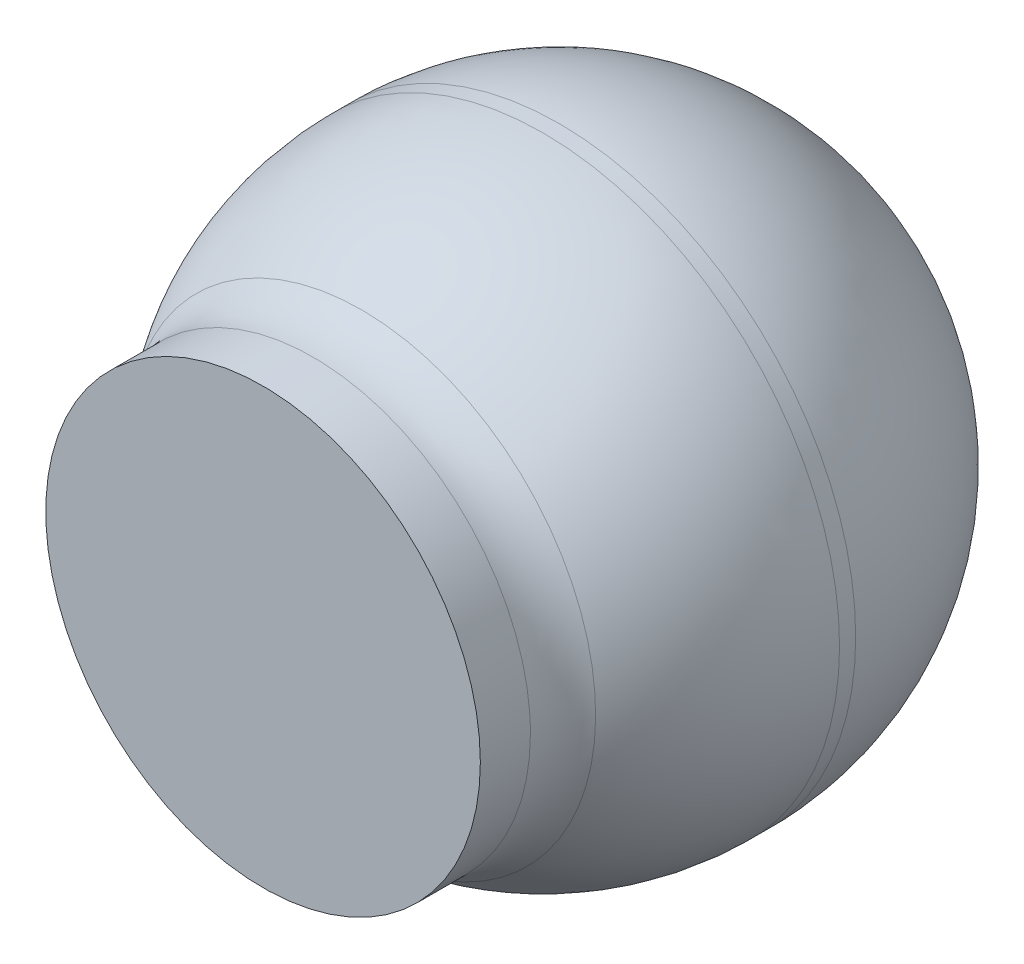
ISO-10303-21;
HEADER;
FILE_DESCRIPTION(('STEP AP214'),'2;1');
FILE_NAME('part.step','',(''),(''),'','','');
FILE_SCHEMA(('AUTOMOTIVE_DESIGN { 1 0 10303 214 1 1 1 1 }'));
ENDSEC;
DATA;
#1=APPLICATION_CONTEXT('core data for automotive mechanical design processes');
#2=APPLICATION_PROTOCOL_DEFINITION('international standard','automotive_design',2000,#1);
#3=PRODUCT_CONTEXT('',#1,'mechanical');
#4=PRODUCT('Part','Part','',(#3));
#5=PRODUCT_RELATED_PRODUCT_CATEGORY('part','',(#4));
#6=PRODUCT_DEFINITION_FORMATION('','',#4);
#7=PRODUCT_DEFINITION_CONTEXT('part definition',#1,'design');
#8=PRODUCT_DEFINITION('design','',#6,#7);
#9=PRODUCT_DEFINITION_SHAPE('','',#8);
#10=(LENGTH_UNIT() NAMED_UNIT(*) SI_UNIT(.MILLI.,.METRE.));
#11=(NAMED_UNIT(*) PLANE_ANGLE_UNIT() SI_UNIT($,.RADIAN.));
#12=(NAMED_UNIT(*) SI_UNIT($,.STERADIAN.) SOLID_ANGLE_UNIT());
#13=UNCERTAINTY_MEASURE_WITH_UNIT(LENGTH_MEASURE(1.E-05),#10,'distance_accuracy_value','');
#14=(GEOMETRIC_REPRESENTATION_CONTEXT(3) GLOBAL_UNCERTAINTY_ASSIGNED_CONTEXT((#13)) GLOBAL_UNIT_ASSIGNED_CONTEXT((#10,
#11,#12)) REPRESENTATION_CONTEXT('',''));
#15=CARTESIAN_POINT('',(0.,0.,0.));
#16=DIRECTION('',(0.,0.,1.));
#17=DIRECTION('',(1.,0.,0.));
#18=AXIS2_PLACEMENT_3D('',#15,#16,#17);
#19=CARTESIAN_POINT('',(0.707080077731,-0.241349291452,10.006534503384));
#20=DIRECTION('',(0.,0.,-1.));
#21=DIRECTION('',(-1.,0.,0.));
#22=AXIS2_PLACEMENT_3D('',#19,#20,#21);
#23=PLANE('',#22);
#24=CARTESIAN_POINT('',(0.707080077731,-0.241349291452,10.006534503384));
#25=DIRECTION('',(0.,0.,1.));
#26=DIRECTION('',(1.,0.,0.));
#27=AXIS2_PLACEMENT_3D('',#24,#25,#26);
#28=CIRCLE('',#27,0.275);
#29=CARTESIAN_POINT('',(0.982080077731,-0.241349291452,10.006534503384));
#30=VERTEX_POINT('',#29);
#31=EDGE_CURVE('E20',#30,#30,#28,.F.);
#32=ORIENTED_EDGE('',*,*,#31,.F.);
#33=EDGE_LOOP('',(#32));
#34=FACE_BOUND('',#33,.T.);
#35=ADVANCED_FACE('F17',(#34),#23,.F.);
#36=CARTESIAN_POINT('',(0.707080077731,-0.241349291452,9.906534503384));
#37=DIRECTION('',(0.,0.,1.));
#38=DIRECTION('',(1.,0.,0.));
#39=AXIS2_PLACEMENT_3D('',#36,#37,#38);
#40=CYLINDRICAL_SURFACE('',#39,0.275);
#41=CARTESIAN_POINT('',(0.707080077731,-0.241349291452,9.943180457728));
#42=DIRECTION('',(0.,0.,-1.));
#43=DIRECTION('',(0.996700902337583,0.081162252799246,0.));
#44=AXIS2_PLACEMENT_3D('',#41,#42,#43);
#45=CIRCLE('',#44,0.275);
#46=CARTESIAN_POINT('',(0.981172825873835,-0.219029671932207,9.943180457728));
#47=VERTEX_POINT('',#46);
#48=EDGE_CURVE('E65',#47,#47,#45,.F.);
#49=ORIENTED_EDGE('',*,*,#48,.T.);
#50=EDGE_LOOP('',(#49));
#51=FACE_BOUND('',#50,.T.);
#52=ORIENTED_EDGE('',*,*,#31,.T.);
#53=EDGE_LOOP('',(#52));
#54=FACE_BOUND('',#53,.T.);
#55=ADVANCED_FACE('F62',(#51,#54),#40,.T.);
#56=CARTESIAN_POINT('',(0.707080077731,-0.241349291452,9.943180457728));
#57=DIRECTION('',(0.,0.,-1.));
#58=DIRECTION('',(0.996700902337583,0.081162252799246,0.));
#59=AXIS2_PLACEMENT_3D('',#56,#57,#58);
#60=TOROIDAL_SURFACE('',#59,0.375,0.1);
#61=ORIENTED_EDGE('',*,*,#48,.F.);
#62=EDGE_LOOP('',(#61));
#63=FACE_BOUND('',#62,.T.);
#64=CARTESIAN_POINT('',(0.707080077731001,-0.241349291452,9.881744931236));
#65=DIRECTION('',(0.,0.,-1.));
#66=DIRECTION('',(-0.996700902337598,-0.0811622527990606,0.));
#67=AXIS2_PLACEMENT_3D('',#64,#65,#66);
#68=CIRCLE('',#67,0.296097046412665);
#69=CARTESIAN_POINT('',(0.411959884392,-0.265381194786,9.881744931236));
#70=VERTEX_POINT('',#69);
#71=EDGE_CURVE('E39',#70,#70,#68,.T.);
#72=ORIENTED_EDGE('',*,*,#71,.F.);
#73=EDGE_LOOP('',(#72));
#74=FACE_BOUND('',#73,.T.);
#75=ADVANCED_FACE('F57',(#63,#74),#60,.F.);
#76=CARTESIAN_POINT('',(0.333317239355,-0.271785136252,9.651976062157));
#77=CARTESIAN_POINT('',(0.333317239355,-0.271785136252,9.701461392103));
#78=CARTESIAN_POINT('',(0.341473782652,-0.271120941579,9.750947004335));
#79=CARTESIAN_POINT('',(0.357792914651,-0.269792059952,9.798626332798));
#80=CARTESIAN_POINT('',(0.381658609162,-0.267848654938,9.842699544317));
#81=CARTESIAN_POINT('',(0.411959884392,-0.265381194786,9.881744931236));
#82=(BOUNDED_CURVE() B_SPLINE_CURVE(5,(#76,#77,#78,#79,#80,#81),.UNSPECIFIED.,.F.,
.F.) B_SPLINE_CURVE_WITH_KNOTS((6,6),(0.,0.661568582165),
.UNSPECIFIED.) CURVE() GEOMETRIC_REPRESENTATION_ITEM() RATIONAL_B_SPLINE_CURVE((1.,1.,1.,1.,1.,1.)) REPRESENTATION_ITEM(''));
#83=CARTESIAN_POINT('',(0.707080077731,-0.241349291452,9.651976062157));
#84=DIRECTION('',(0.,0.,-1.));
#85=AXIS1_PLACEMENT('',#83,#84);
#86=SURFACE_OF_REVOLUTION('',#82,#85);
#87=CARTESIAN_POINT('',(0.707080077731001,-0.241349291452,9.651976062157));
#88=DIRECTION('',(0.,0.,1.));
#89=DIRECTION('',(1.,0.,0.));
#90=AXIS2_PLACEMENT_3D('',#87,#88,#89);
#91=CIRCLE('',#90,0.375);
#92=CARTESIAN_POINT('',(1.082080077731,-0.241349291452,9.651976062157));
#93=VERTEX_POINT('',#92);
#94=EDGE_CURVE('E36',#93,#93,#91,.F.);
#95=ORIENTED_EDGE('',*,*,#94,.F.);
#96=EDGE_LOOP('',(#95));
#97=FACE_BOUND('',#96,.T.);
#98=ORIENTED_EDGE('',*,*,#71,.T.);
#99=EDGE_LOOP('',(#98));
#100=FACE_BOUND('',#99,.T.);
#101=ADVANCED_FACE('F53',(#97,#100),#86,.F.);
#102=CARTESIAN_POINT('',(0.707080077731,-0.241349291452,9.256534503384));
#103=DIRECTION('',(0.,0.,1.));
#104=DIRECTION('',(1.,0.,0.));
#105=AXIS2_PLACEMENT_3D('',#102,#103,#104);
#106=CYLINDRICAL_SURFACE('',#105,0.375);
#107=CARTESIAN_POINT('',(0.707080077731,-0.241349291452,9.631534503384));
#108=DIRECTION('',(0.,0.,-1.));
#109=DIRECTION('',(0.0811622527992362,-0.996700902337583,0.));
#110=AXIS2_PLACEMENT_3D('',#107,#108,#109);
#111=CIRCLE('',#110,0.375);
#112=CARTESIAN_POINT('',(0.737515922530713,-0.615112129828594,9.631534503384));
#113=VERTEX_POINT('',#112);
#114=CARTESIAN_POINT('',(0.676644232931287,0.132413546924594,9.631534503384));
#115=VERTEX_POINT('',#114);
#116=EDGE_CURVE('E11',#113,#115,#111,.T.);
#117=ORIENTED_EDGE('',*,*,#116,.F.);
#118=CARTESIAN_POINT('',(0.707080077731,-0.241349291452,9.631534503384));
#119=DIRECTION('',(0.,0.,1.));
#120=DIRECTION('',(0.081162252799236,-0.996700902337583,0.));
#121=AXIS2_PLACEMENT_3D('',#118,#119,#120);
#122=CIRCLE('',#121,0.375);
#123=EDGE_CURVE('E25',#115,#113,#122,.F.);
#124=ORIENTED_EDGE('',*,*,#123,.F.);
#125=EDGE_LOOP('',(#117,#124));
#126=FACE_BOUND('',#125,.T.);
#127=ORIENTED_EDGE('',*,*,#94,.T.);
#128=EDGE_LOOP('',(#127));
#129=FACE_BOUND('',#128,.T.);
#130=ADVANCED_FACE('F34',(#126,#129),#106,.T.);
#131=CARTESIAN_POINT('',(0.707080077731,-0.241349291452,9.631534503384));
#132=DIRECTION('',(0.0811622527992361,-0.996700902337583,0.));
#133=DIRECTION('',(-0.996700902337583,-0.0811622527992361,0.));
#134=AXIS2_PLACEMENT_3D('',#131,#132,#133);
#135=SPHERICAL_SURFACE('',#134,0.375);
#136=ORIENTED_EDGE('',*,*,#123,.T.);
#137=ORIENTED_EDGE('',*,*,#116,.T.);
#138=EDGE_LOOP('',(#136,#137));
#139=FACE_BOUND('',#138,.T.);
#140=ADVANCED_FACE('F32',(#139),#135,.T.);
#141=CLOSED_SHELL('',(#35,#55,#75,#101,#130,#140));
#142=MANIFOLD_SOLID_BREP('B1',#141);
#143=ADVANCED_BREP_SHAPE_REPRESENTATION('',(#18,#142),#14);
#144=SHAPE_DEFINITION_REPRESENTATION(#9,#143);
ENDSEC;
END-ISO-10303-21;
